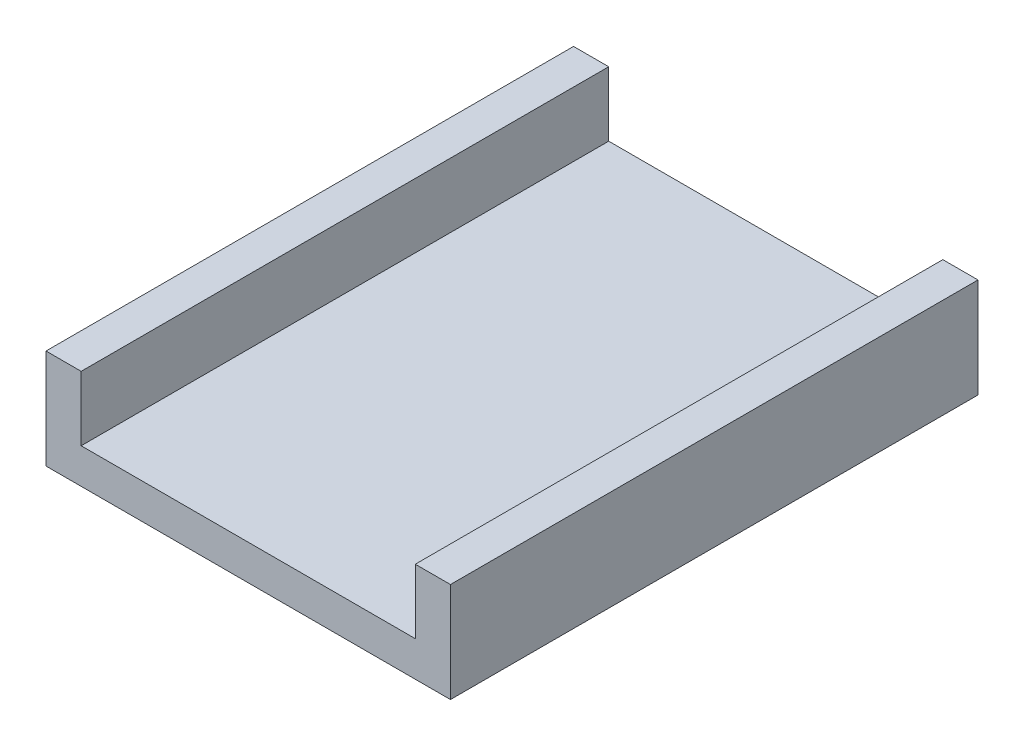
ISO-10303-21;
HEADER;
FILE_DESCRIPTION(('STEP AP214'),'2;1');
FILE_NAME('part.step','',(''),(''),'','','');
FILE_SCHEMA(('AUTOMOTIVE_DESIGN { 1 0 10303 214 1 1 1 1 }'));
ENDSEC;
DATA;
#1=APPLICATION_CONTEXT('core data for automotive mechanical design processes');
#2=APPLICATION_PROTOCOL_DEFINITION('international standard','automotive_design',2000,#1);
#3=PRODUCT_CONTEXT('',#1,'mechanical');
#4=PRODUCT('Part','Part','',(#3));
#5=PRODUCT_RELATED_PRODUCT_CATEGORY('part','',(#4));
#6=PRODUCT_DEFINITION_FORMATION('','',#4);
#7=PRODUCT_DEFINITION_CONTEXT('part definition',#1,'design');
#8=PRODUCT_DEFINITION('design','',#6,#7);
#9=PRODUCT_DEFINITION_SHAPE('','',#8);
#10=(LENGTH_UNIT() NAMED_UNIT(*) SI_UNIT(.MILLI.,.METRE.));
#11=(NAMED_UNIT(*) PLANE_ANGLE_UNIT() SI_UNIT($,.RADIAN.));
#12=(NAMED_UNIT(*) SI_UNIT($,.STERADIAN.) SOLID_ANGLE_UNIT());
#13=UNCERTAINTY_MEASURE_WITH_UNIT(LENGTH_MEASURE(1.E-05),#10,'distance_accuracy_value','');
#14=(GEOMETRIC_REPRESENTATION_CONTEXT(3) GLOBAL_UNCERTAINTY_ASSIGNED_CONTEXT((#13)) GLOBAL_UNIT_ASSIGNED_CONTEXT((#10,
#11,#12)) REPRESENTATION_CONTEXT('',''));
#15=CARTESIAN_POINT('',(0.,0.,0.));
#16=DIRECTION('',(0.,0.,1.));
#17=DIRECTION('',(1.,0.,0.));
#18=AXIS2_PLACEMENT_3D('',#15,#16,#17);
#19=CARTESIAN_POINT('',(0.,3.,0.));
#20=DIRECTION('',(0.,-1.,0.));
#21=DIRECTION('',(0.,0.,-1.));
#22=AXIS2_PLACEMENT_3D('',#19,#20,#21);
#23=PLANE('',#22);
#24=DIRECTION('',(0.,0.,1.));
#25=VECTOR('',#24,1.);
#26=CARTESIAN_POINT('',(14.25,3.,-22.5));
#27=LINE('',#26,#25);
#28=CARTESIAN_POINT('',(14.25,3.,-22.5));
#29=VERTEX_POINT('',#28);
#30=CARTESIAN_POINT('',(14.25,3.,22.5));
#31=VERTEX_POINT('',#30);
#32=EDGE_CURVE('E55',#29,#31,#27,.T.);
#33=ORIENTED_EDGE('',*,*,#32,.F.);
#34=DIRECTION('',(-1.,0.,0.));
#35=VECTOR('',#34,1.);
#36=CARTESIAN_POINT('',(-17.25,3.,-22.5));
#37=LINE('',#36,#35);
#38=CARTESIAN_POINT('',(-14.25,3.,-22.5));
#39=VERTEX_POINT('',#38);
#40=EDGE_CURVE('E41',#29,#39,#37,.T.);
#41=ORIENTED_EDGE('',*,*,#40,.T.);
#42=DIRECTION('',(0.,0.,-1.));
#43=VECTOR('',#42,1.);
#44=CARTESIAN_POINT('',(-14.25,3.,-22.5));
#45=LINE('',#44,#43);
#46=CARTESIAN_POINT('',(-14.25,3.,22.5));
#47=VERTEX_POINT('',#46);
#48=EDGE_CURVE('E125',#47,#39,#45,.T.);
#49=ORIENTED_EDGE('',*,*,#48,.F.);
#50=DIRECTION('',(1.,0.,0.));
#51=VECTOR('',#50,1.);
#52=CARTESIAN_POINT('',(-17.25,3.,22.5));
#53=LINE('',#52,#51);
#54=EDGE_CURVE('E60',#47,#31,#53,.T.);
#55=ORIENTED_EDGE('',*,*,#54,.T.);
#56=EDGE_LOOP('',(#33,#41,#49,#55));
#57=FACE_BOUND('',#56,.T.);
#58=ADVANCED_FACE('F37',(#57),#23,.F.);
#59=CARTESIAN_POINT('',(17.25,3.,22.5));
#60=DIRECTION('',(-1.,0.,0.));
#61=DIRECTION('',(0.,0.,1.));
#62=AXIS2_PLACEMENT_3D('',#59,#60,#61);
#63=PLANE('',#62);
#64=DIRECTION('',(0.,0.,-1.));
#65=VECTOR('',#64,1.);
#66=CARTESIAN_POINT('',(17.25,0.,22.5));
#67=LINE('',#66,#65);
#68=CARTESIAN_POINT('',(17.25,0.,22.5));
#69=VERTEX_POINT('',#68);
#70=CARTESIAN_POINT('',(17.25,0.,-22.5));
#71=VERTEX_POINT('',#70);
#72=EDGE_CURVE('E153',#69,#71,#67,.T.);
#73=ORIENTED_EDGE('',*,*,#72,.T.);
#74=DIRECTION('',(0.,-1.,0.));
#75=VECTOR('',#74,1.);
#76=CARTESIAN_POINT('',(17.25,3.,-22.5));
#77=LINE('',#76,#75);
#78=CARTESIAN_POINT('',(17.25,8.5,-22.5));
#79=VERTEX_POINT('',#78);
#80=EDGE_CURVE('E11',#79,#71,#77,.T.);
#81=ORIENTED_EDGE('',*,*,#80,.F.);
#82=DIRECTION('',(0.,0.,-1.));
#83=VECTOR('',#82,1.);
#84=CARTESIAN_POINT('',(17.25,8.5,-22.5));
#85=LINE('',#84,#83);
#86=CARTESIAN_POINT('',(17.25,8.5,22.5));
#87=VERTEX_POINT('',#86);
#88=EDGE_CURVE('E119',#87,#79,#85,.T.);
#89=ORIENTED_EDGE('',*,*,#88,.F.);
#90=DIRECTION('',(0.,-1.,0.));
#91=VECTOR('',#90,1.);
#92=CARTESIAN_POINT('',(17.25,3.,22.5));
#93=LINE('',#92,#91);
#94=EDGE_CURVE('E172',#87,#69,#93,.T.);
#95=ORIENTED_EDGE('',*,*,#94,.T.);
#96=EDGE_LOOP('',(#73,#81,#89,#95));
#97=FACE_BOUND('',#96,.T.);
#98=ADVANCED_FACE('F39',(#97),#63,.F.);
#99=CARTESIAN_POINT('',(-17.25,3.,-22.5));
#100=DIRECTION('',(0.,0.,1.));
#101=DIRECTION('',(1.,0.,0.));
#102=AXIS2_PLACEMENT_3D('',#99,#100,#101);
#103=PLANE('',#102);
#104=DIRECTION('',(-1.,0.,0.));
#105=VECTOR('',#104,1.);
#106=CARTESIAN_POINT('',(-17.25,0.,-22.5));
#107=LINE('',#106,#105);
#108=CARTESIAN_POINT('',(-17.25,0.,-22.5));
#109=VERTEX_POINT('',#108);
#110=EDGE_CURVE('E159',#71,#109,#107,.T.);
#111=ORIENTED_EDGE('',*,*,#110,.T.);
#112=DIRECTION('',(0.,-1.,0.));
#113=VECTOR('',#112,1.);
#114=CARTESIAN_POINT('',(-17.25,3.,-22.5));
#115=LINE('',#114,#113);
#116=CARTESIAN_POINT('',(-17.25,8.5,-22.5));
#117=VERTEX_POINT('',#116);
#118=EDGE_CURVE('E47',#117,#109,#115,.T.);
#119=ORIENTED_EDGE('',*,*,#118,.F.);
#120=DIRECTION('',(-1.,0.,0.));
#121=VECTOR('',#120,1.);
#122=CARTESIAN_POINT('',(-14.25,8.5,-22.5));
#123=LINE('',#122,#121);
#124=CARTESIAN_POINT('',(-14.25,8.5,-22.5));
#125=VERTEX_POINT('',#124);
#126=EDGE_CURVE('E128',#125,#117,#123,.T.);
#127=ORIENTED_EDGE('',*,*,#126,.F.);
#128=DIRECTION('',(0.,-1.,0.));
#129=VECTOR('',#128,1.);
#130=CARTESIAN_POINT('',(-14.25,8.5,-22.5));
#131=LINE('',#130,#129);
#132=EDGE_CURVE('E142',#125,#39,#131,.T.);
#133=ORIENTED_EDGE('',*,*,#132,.T.);
#134=ORIENTED_EDGE('',*,*,#40,.F.);
#135=DIRECTION('',(0.,-1.,0.));
#136=VECTOR('',#135,1.);
#137=CARTESIAN_POINT('',(14.25,8.5,-22.5));
#138=LINE('',#137,#136);
#139=CARTESIAN_POINT('',(14.25,8.5,-22.5));
#140=VERTEX_POINT('',#139);
#141=EDGE_CURVE('E106',#140,#29,#138,.T.);
#142=ORIENTED_EDGE('',*,*,#141,.F.);
#143=DIRECTION('',(-1.,0.,0.));
#144=VECTOR('',#143,1.);
#145=CARTESIAN_POINT('',(14.25,8.5,-22.5));
#146=LINE('',#145,#144);
#147=EDGE_CURVE('E113',#79,#140,#146,.T.);
#148=ORIENTED_EDGE('',*,*,#147,.F.);
#149=ORIENTED_EDGE('',*,*,#80,.T.);
#150=EDGE_LOOP('',(#111,#119,#127,#133,#134,#142,#148,#149));
#151=FACE_BOUND('',#150,.T.);
#152=ADVANCED_FACE('F123',(#151),#103,.F.);
#153=CARTESIAN_POINT('',(-17.25,3.,22.5));
#154=DIRECTION('',(1.,0.,0.));
#155=DIRECTION('',(0.,0.,-1.));
#156=AXIS2_PLACEMENT_3D('',#153,#154,#155);
#157=PLANE('',#156);
#158=DIRECTION('',(0.,0.,1.));
#159=VECTOR('',#158,1.);
#160=CARTESIAN_POINT('',(-17.25,0.,22.5));
#161=LINE('',#160,#159);
#162=CARTESIAN_POINT('',(-17.25,0.,22.5));
#163=VERTEX_POINT('',#162);
#164=EDGE_CURVE('E163',#109,#163,#161,.T.);
#165=ORIENTED_EDGE('',*,*,#164,.T.);
#166=DIRECTION('',(0.,-1.,0.));
#167=VECTOR('',#166,1.);
#168=CARTESIAN_POINT('',(-17.25,3.,22.5));
#169=LINE('',#168,#167);
#170=CARTESIAN_POINT('',(-17.25,8.5,22.5));
#171=VERTEX_POINT('',#170);
#172=EDGE_CURVE('E174',#171,#163,#169,.T.);
#173=ORIENTED_EDGE('',*,*,#172,.F.);
#174=DIRECTION('',(0.,0.,1.));
#175=VECTOR('',#174,1.);
#176=CARTESIAN_POINT('',(-17.25,8.5,-22.5));
#177=LINE('',#176,#175);
#178=EDGE_CURVE('E135',#117,#171,#177,.T.);
#179=ORIENTED_EDGE('',*,*,#178,.F.);
#180=ORIENTED_EDGE('',*,*,#118,.T.);
#181=EDGE_LOOP('',(#165,#173,#179,#180));
#182=FACE_BOUND('',#181,.T.);
#183=ADVANCED_FACE('F178',(#182),#157,.F.);
#184=CARTESIAN_POINT('',(-17.25,3.,22.5));
#185=DIRECTION('',(0.,0.,-1.));
#186=DIRECTION('',(-1.,0.,0.));
#187=AXIS2_PLACEMENT_3D('',#184,#185,#186);
#188=PLANE('',#187);
#189=DIRECTION('',(1.,0.,0.));
#190=VECTOR('',#189,1.);
#191=CARTESIAN_POINT('',(-17.25,0.,22.5));
#192=LINE('',#191,#190);
#193=EDGE_CURVE('E169',#163,#69,#192,.T.);
#194=ORIENTED_EDGE('',*,*,#193,.T.);
#195=ORIENTED_EDGE('',*,*,#94,.F.);
#196=DIRECTION('',(1.,0.,0.));
#197=VECTOR('',#196,1.);
#198=CARTESIAN_POINT('',(17.25,8.5,22.5));
#199=LINE('',#198,#197);
#200=CARTESIAN_POINT('',(14.25,8.5,22.5));
#201=VERTEX_POINT('',#200);
#202=EDGE_CURVE('E112',#201,#87,#199,.T.);
#203=ORIENTED_EDGE('',*,*,#202,.F.);
#204=DIRECTION('',(0.,-1.,0.));
#205=VECTOR('',#204,1.);
#206=CARTESIAN_POINT('',(14.25,8.5,22.5));
#207=LINE('',#206,#205);
#208=EDGE_CURVE('E108',#201,#31,#207,.T.);
#209=ORIENTED_EDGE('',*,*,#208,.T.);
#210=ORIENTED_EDGE('',*,*,#54,.F.);
#211=DIRECTION('',(0.,-1.,0.));
#212=VECTOR('',#211,1.);
#213=CARTESIAN_POINT('',(-14.25,8.5,22.5));
#214=LINE('',#213,#212);
#215=CARTESIAN_POINT('',(-14.25,8.5,22.5));
#216=VERTEX_POINT('',#215);
#217=EDGE_CURVE('E149',#216,#47,#214,.T.);
#218=ORIENTED_EDGE('',*,*,#217,.F.);
#219=DIRECTION('',(1.,0.,0.));
#220=VECTOR('',#219,1.);
#221=CARTESIAN_POINT('',(-17.25,8.5,22.5));
#222=LINE('',#221,#220);
#223=EDGE_CURVE('E138',#171,#216,#222,.T.);
#224=ORIENTED_EDGE('',*,*,#223,.F.);
#225=ORIENTED_EDGE('',*,*,#172,.T.);
#226=EDGE_LOOP('',(#194,#195,#203,#209,#210,#218,#224,#225));
#227=FACE_BOUND('',#226,.T.);
#228=ADVANCED_FACE('F186',(#227),#188,.F.);
#229=CARTESIAN_POINT('',(0.,0.,0.));
#230=DIRECTION('',(0.,-1.,0.));
#231=DIRECTION('',(0.,0.,-1.));
#232=AXIS2_PLACEMENT_3D('',#229,#230,#231);
#233=PLANE('',#232);
#234=ORIENTED_EDGE('',*,*,#72,.F.);
#235=ORIENTED_EDGE('',*,*,#193,.F.);
#236=ORIENTED_EDGE('',*,*,#164,.F.);
#237=ORIENTED_EDGE('',*,*,#110,.F.);
#238=EDGE_LOOP('',(#234,#235,#236,#237));
#239=FACE_BOUND('',#238,.T.);
#240=ADVANCED_FACE('F184',(#239),#233,.T.);
#241=CARTESIAN_POINT('',(-14.25,8.5,-22.5));
#242=DIRECTION('',(-1.,0.,0.));
#243=DIRECTION('',(0.,0.,1.));
#244=AXIS2_PLACEMENT_3D('',#241,#242,#243);
#245=PLANE('',#244);
#246=ORIENTED_EDGE('',*,*,#48,.T.);
#247=ORIENTED_EDGE('',*,*,#132,.F.);
#248=DIRECTION('',(0.,0.,-1.));
#249=VECTOR('',#248,1.);
#250=CARTESIAN_POINT('',(-14.25,8.5,-22.5));
#251=LINE('',#250,#249);
#252=EDGE_CURVE('E140',#216,#125,#251,.T.);
#253=ORIENTED_EDGE('',*,*,#252,.F.);
#254=ORIENTED_EDGE('',*,*,#217,.T.);
#255=EDGE_LOOP('',(#246,#247,#253,#254));
#256=FACE_BOUND('',#255,.T.);
#257=ADVANCED_FACE('F191',(#256),#245,.F.);
#258=CARTESIAN_POINT('',(0.,8.5,0.));
#259=DIRECTION('',(0.,1.,0.));
#260=DIRECTION('',(0.,0.,1.));
#261=AXIS2_PLACEMENT_3D('',#258,#259,#260);
#262=PLANE('',#261);
#263=ORIENTED_EDGE('',*,*,#126,.T.);
#264=ORIENTED_EDGE('',*,*,#178,.T.);
#265=ORIENTED_EDGE('',*,*,#223,.T.);
#266=ORIENTED_EDGE('',*,*,#252,.T.);
#267=EDGE_LOOP('',(#263,#264,#265,#266));
#268=FACE_BOUND('',#267,.T.);
#269=ADVANCED_FACE('F189',(#268),#262,.T.);
#270=CARTESIAN_POINT('',(14.25,8.5,-22.5));
#271=DIRECTION('',(1.,0.,0.));
#272=DIRECTION('',(0.,0.,-1.));
#273=AXIS2_PLACEMENT_3D('',#270,#271,#272);
#274=PLANE('',#273);
#275=ORIENTED_EDGE('',*,*,#32,.T.);
#276=ORIENTED_EDGE('',*,*,#208,.F.);
#277=DIRECTION('',(0.,0.,1.));
#278=VECTOR('',#277,1.);
#279=CARTESIAN_POINT('',(14.25,8.5,-22.5));
#280=LINE('',#279,#278);
#281=EDGE_CURVE('E102',#140,#201,#280,.T.);
#282=ORIENTED_EDGE('',*,*,#281,.F.);
#283=ORIENTED_EDGE('',*,*,#141,.T.);
#284=EDGE_LOOP('',(#275,#276,#282,#283));
#285=FACE_BOUND('',#284,.T.);
#286=ADVANCED_FACE('F104',(#285),#274,.F.);
#287=CARTESIAN_POINT('',(0.,8.5,0.));
#288=DIRECTION('',(0.,-1.,0.));
#289=DIRECTION('',(0.,0.,-1.));
#290=AXIS2_PLACEMENT_3D('',#287,#288,#289);
#291=PLANE('',#290);
#292=ORIENTED_EDGE('',*,*,#147,.T.);
#293=ORIENTED_EDGE('',*,*,#281,.T.);
#294=ORIENTED_EDGE('',*,*,#202,.T.);
#295=ORIENTED_EDGE('',*,*,#88,.T.);
#296=EDGE_LOOP('',(#292,#293,#294,#295));
#297=FACE_BOUND('',#296,.T.);
#298=ADVANCED_FACE('F117',(#297),#291,.F.);
#299=CLOSED_SHELL('',(#58,#98,#152,#183,#228,#240,#257,#269,#286,#298));
#300=MANIFOLD_SOLID_BREP('B2',#299);
#301=ADVANCED_BREP_SHAPE_REPRESENTATION('',(#18,#300),#14);
#302=SHAPE_DEFINITION_REPRESENTATION(#9,#301);
ENDSEC;
END-ISO-10303-21;
